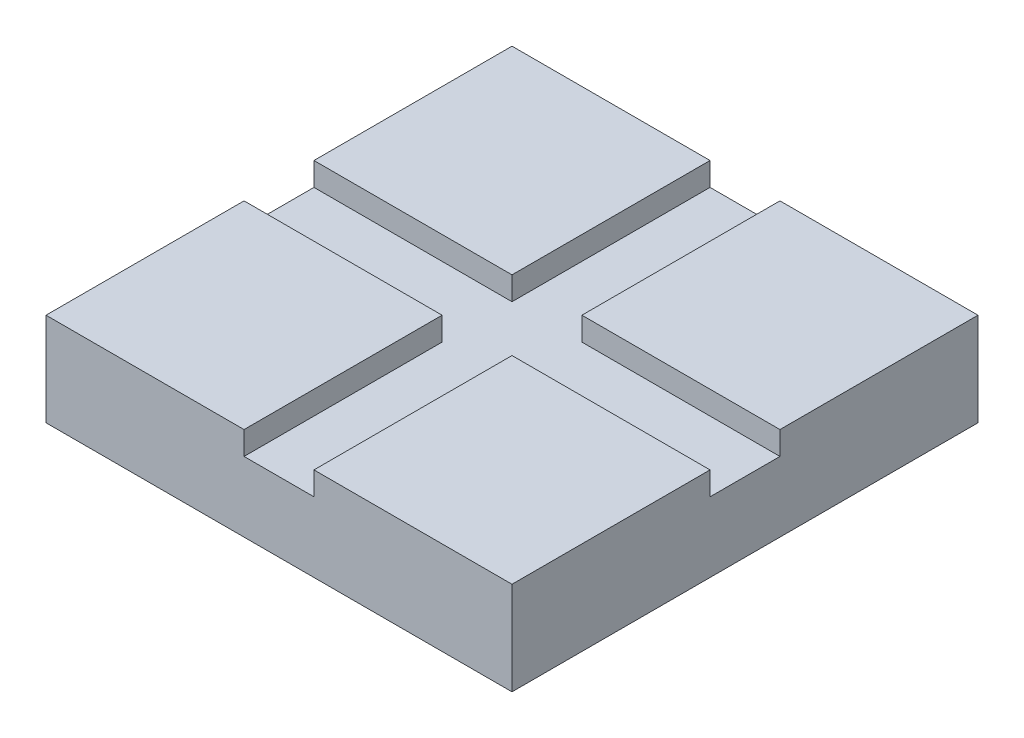
ISO-10303-21;
HEADER;
FILE_DESCRIPTION(('STEP AP214'),'2;1');
FILE_NAME('part.step','',(''),(''),'','','');
FILE_SCHEMA(('AUTOMOTIVE_DESIGN { 1 0 10303 214 1 1 1 1 }'));
ENDSEC;
DATA;
#1=APPLICATION_CONTEXT('core data for automotive mechanical design processes');
#2=APPLICATION_PROTOCOL_DEFINITION('international standard','automotive_design',2000,#1);
#3=PRODUCT_CONTEXT('',#1,'mechanical');
#4=PRODUCT('Part','Part','',(#3));
#5=PRODUCT_RELATED_PRODUCT_CATEGORY('part','',(#4));
#6=PRODUCT_DEFINITION_FORMATION('','',#4);
#7=PRODUCT_DEFINITION_CONTEXT('part definition',#1,'design');
#8=PRODUCT_DEFINITION('design','',#6,#7);
#9=PRODUCT_DEFINITION_SHAPE('','',#8);
#10=(LENGTH_UNIT() NAMED_UNIT(*) SI_UNIT(.MILLI.,.METRE.));
#11=(NAMED_UNIT(*) PLANE_ANGLE_UNIT() SI_UNIT($,.RADIAN.));
#12=(NAMED_UNIT(*) SI_UNIT($,.STERADIAN.) SOLID_ANGLE_UNIT());
#13=UNCERTAINTY_MEASURE_WITH_UNIT(LENGTH_MEASURE(1.E-05),#10,'distance_accuracy_value','');
#14=(GEOMETRIC_REPRESENTATION_CONTEXT(3) GLOBAL_UNCERTAINTY_ASSIGNED_CONTEXT((#13)) GLOBAL_UNIT_ASSIGNED_CONTEXT((#10,
#11,#12)) REPRESENTATION_CONTEXT('',''));
#15=CARTESIAN_POINT('',(0.,0.,0.));
#16=DIRECTION('',(0.,0.,1.));
#17=DIRECTION('',(1.,0.,0.));
#18=AXIS2_PLACEMENT_3D('',#15,#16,#17);
#19=CARTESIAN_POINT('',(0.,20.,-7.50000000000002));
#20=DIRECTION('',(0.,0.,-1.));
#21=DIRECTION('',(-1.,0.,0.));
#22=AXIS2_PLACEMENT_3D('',#19,#20,#21);
#23=PLANE('',#22);
#24=DIRECTION('',(0.,-1.,0.));
#25=VECTOR('',#24,1.);
#26=CARTESIAN_POINT('',(-50.,20.,-7.49999999999997));
#27=LINE('',#26,#25);
#28=CARTESIAN_POINT('',(-50.,20.,-7.49999999999997));
#29=VERTEX_POINT('',#28);
#30=CARTESIAN_POINT('',(-50.,15.,-7.49999999999997));
#31=VERTEX_POINT('',#30);
#32=EDGE_CURVE('E266',#29,#31,#27,.T.);
#33=ORIENTED_EDGE('',*,*,#32,.T.);
#34=DIRECTION('',(1.,0.,0.));
#35=VECTOR('',#34,1.);
#36=CARTESIAN_POINT('',(0.,15.,-7.50000000000002));
#37=LINE('',#36,#35);
#38=CARTESIAN_POINT('',(-7.50000000000001,15.,-7.50000000000001));
#39=VERTEX_POINT('',#38);
#40=EDGE_CURVE('E47',#31,#39,#37,.T.);
#41=ORIENTED_EDGE('',*,*,#40,.T.);
#42=DIRECTION('',(0.,-1.,0.));
#43=VECTOR('',#42,1.);
#44=CARTESIAN_POINT('',(-7.50000000000001,20.,-7.50000000000001));
#45=LINE('',#44,#43);
#46=CARTESIAN_POINT('',(-7.50000000000001,20.,-7.50000000000001));
#47=VERTEX_POINT('',#46);
#48=EDGE_CURVE('E11',#47,#39,#45,.T.);
#49=ORIENTED_EDGE('',*,*,#48,.F.);
#50=DIRECTION('',(1.,0.,0.));
#51=VECTOR('',#50,1.);
#52=CARTESIAN_POINT('',(0.,20.,-7.50000000000002));
#53=LINE('',#52,#51);
#54=EDGE_CURVE('E254',#29,#47,#53,.T.);
#55=ORIENTED_EDGE('',*,*,#54,.F.);
#56=EDGE_LOOP('',(#33,#41,#49,#55));
#57=FACE_BOUND('',#56,.T.);
#58=ADVANCED_FACE('F33',(#57),#23,.F.);
#59=CARTESIAN_POINT('',(-7.50000000000001,20.,0.));
#60=DIRECTION('',(-1.,0.,0.));
#61=DIRECTION('',(0.,0.,1.));
#62=AXIS2_PLACEMENT_3D('',#59,#60,#61);
#63=PLANE('',#62);
#64=ORIENTED_EDGE('',*,*,#48,.T.);
#65=DIRECTION('',(0.,0.,-1.));
#66=VECTOR('',#65,1.);
#67=CARTESIAN_POINT('',(-7.50000000000001,15.,0.));
#68=LINE('',#67,#66);
#69=CARTESIAN_POINT('',(-7.50000000000001,15.,-50.));
#70=VERTEX_POINT('',#69);
#71=EDGE_CURVE('E53',#39,#70,#68,.T.);
#72=ORIENTED_EDGE('',*,*,#71,.T.);
#73=DIRECTION('',(0.,-1.,0.));
#74=VECTOR('',#73,1.);
#75=CARTESIAN_POINT('',(-7.50000000000001,20.,-50.));
#76=LINE('',#75,#74);
#77=CARTESIAN_POINT('',(-7.50000000000001,20.,-50.));
#78=VERTEX_POINT('',#77);
#79=EDGE_CURVE('E40',#78,#70,#76,.T.);
#80=ORIENTED_EDGE('',*,*,#79,.F.);
#81=DIRECTION('',(0.,0.,-1.));
#82=VECTOR('',#81,1.);
#83=CARTESIAN_POINT('',(-7.50000000000001,20.,0.));
#84=LINE('',#83,#82);
#85=EDGE_CURVE('E257',#47,#78,#84,.T.);
#86=ORIENTED_EDGE('',*,*,#85,.F.);
#87=EDGE_LOOP('',(#64,#72,#80,#86));
#88=FACE_BOUND('',#87,.T.);
#89=ADVANCED_FACE('F307',(#88),#63,.F.);
#90=CARTESIAN_POINT('',(0.,20.,-50.));
#91=DIRECTION('',(0.,0.,-1.));
#92=DIRECTION('',(-1.,0.,0.));
#93=AXIS2_PLACEMENT_3D('',#90,#91,#92);
#94=PLANE('',#93);
#95=DIRECTION('',(1.,0.,0.));
#96=VECTOR('',#95,1.);
#97=CARTESIAN_POINT('',(0.,0.,-50.));
#98=LINE('',#97,#96);
#99=CARTESIAN_POINT('',(-50.,0.,-50.));
#100=VERTEX_POINT('',#99);
#101=CARTESIAN_POINT('',(50.,0.,-50.));
#102=VERTEX_POINT('',#101);
#103=EDGE_CURVE('E251',#100,#102,#98,.T.);
#104=ORIENTED_EDGE('',*,*,#103,.F.);
#105=DIRECTION('',(0.,-1.,0.));
#106=VECTOR('',#105,1.);
#107=CARTESIAN_POINT('',(-50.,20.,-50.));
#108=LINE('',#107,#106);
#109=CARTESIAN_POINT('',(-50.,20.,-50.));
#110=VERTEX_POINT('',#109);
#111=EDGE_CURVE('E272',#110,#100,#108,.T.);
#112=ORIENTED_EDGE('',*,*,#111,.F.);
#113=DIRECTION('',(1.,0.,0.));
#114=VECTOR('',#113,1.);
#115=CARTESIAN_POINT('',(0.,20.,-50.));
#116=LINE('',#115,#114);
#117=EDGE_CURVE('E260',#110,#78,#116,.T.);
#118=ORIENTED_EDGE('',*,*,#117,.T.);
#119=ORIENTED_EDGE('',*,*,#79,.T.);
#120=DIRECTION('',(1.,0.,0.));
#121=VECTOR('',#120,1.);
#122=CARTESIAN_POINT('',(0.,15.,-50.));
#123=LINE('',#122,#121);
#124=CARTESIAN_POINT('',(7.49999999999999,15.,-50.));
#125=VERTEX_POINT('',#124);
#126=EDGE_CURVE('E248',#70,#125,#123,.T.);
#127=ORIENTED_EDGE('',*,*,#126,.T.);
#128=DIRECTION('',(0.,-1.,0.));
#129=VECTOR('',#128,1.);
#130=CARTESIAN_POINT('',(7.49999999999999,20.,-50.));
#131=LINE('',#130,#129);
#132=CARTESIAN_POINT('',(7.49999999999999,20.,-50.));
#133=VERTEX_POINT('',#132);
#134=EDGE_CURVE('E211',#133,#125,#131,.T.);
#135=ORIENTED_EDGE('',*,*,#134,.F.);
#136=DIRECTION('',(1.,0.,0.));
#137=VECTOR('',#136,1.);
#138=CARTESIAN_POINT('',(0.,20.,-50.));
#139=LINE('',#138,#137);
#140=CARTESIAN_POINT('',(50.,20.,-50.));
#141=VERTEX_POINT('',#140);
#142=EDGE_CURVE('E208',#133,#141,#139,.T.);
#143=ORIENTED_EDGE('',*,*,#142,.T.);
#144=DIRECTION('',(0.,-1.,0.));
#145=VECTOR('',#144,1.);
#146=CARTESIAN_POINT('',(50.,20.,-50.));
#147=LINE('',#146,#145);
#148=EDGE_CURVE('E214',#141,#102,#147,.T.);
#149=ORIENTED_EDGE('',*,*,#148,.T.);
#150=EDGE_LOOP('',(#104,#112,#118,#119,#127,#135,#143,#149));
#151=FACE_BOUND('',#150,.T.);
#152=ADVANCED_FACE('F276',(#151),#94,.T.);
#153=CARTESIAN_POINT('',(-50.,20.,0.));
#154=DIRECTION('',(-1.,0.,0.));
#155=DIRECTION('',(0.,0.,1.));
#156=AXIS2_PLACEMENT_3D('',#153,#154,#155);
#157=PLANE('',#156);
#158=DIRECTION('',(0.,0.,-1.));
#159=VECTOR('',#158,1.);
#160=CARTESIAN_POINT('',(-50.,0.,0.));
#161=LINE('',#160,#159);
#162=CARTESIAN_POINT('',(-50.,0.,50.));
#163=VERTEX_POINT('',#162);
#164=EDGE_CURVE('E258',#163,#100,#161,.T.);
#165=ORIENTED_EDGE('',*,*,#164,.F.);
#166=DIRECTION('',(0.,-1.,0.));
#167=VECTOR('',#166,1.);
#168=CARTESIAN_POINT('',(-50.,20.,50.));
#169=LINE('',#168,#167);
#170=CARTESIAN_POINT('',(-50.,20.,50.));
#171=VERTEX_POINT('',#170);
#172=EDGE_CURVE('E195',#171,#163,#169,.T.);
#173=ORIENTED_EDGE('',*,*,#172,.F.);
#174=DIRECTION('',(0.,0.,-1.));
#175=VECTOR('',#174,1.);
#176=CARTESIAN_POINT('',(-50.,20.,0.));
#177=LINE('',#176,#175);
#178=CARTESIAN_POINT('',(-50.,20.,7.5));
#179=VERTEX_POINT('',#178);
#180=EDGE_CURVE('E182',#171,#179,#177,.T.);
#181=ORIENTED_EDGE('',*,*,#180,.T.);
#182=DIRECTION('',(0.,-1.,0.));
#183=VECTOR('',#182,1.);
#184=CARTESIAN_POINT('',(-50.,20.,7.5));
#185=LINE('',#184,#183);
#186=CARTESIAN_POINT('',(-50.,15.,7.5));
#187=VERTEX_POINT('',#186);
#188=EDGE_CURVE('E198',#179,#187,#185,.T.);
#189=ORIENTED_EDGE('',*,*,#188,.T.);
#190=DIRECTION('',(0.,0.,-1.));
#191=VECTOR('',#190,1.);
#192=CARTESIAN_POINT('',(-50.,15.,0.));
#193=LINE('',#192,#191);
#194=EDGE_CURVE('E227',#187,#31,#193,.T.);
#195=ORIENTED_EDGE('',*,*,#194,.T.);
#196=ORIENTED_EDGE('',*,*,#32,.F.);
#197=DIRECTION('',(0.,0.,-1.));
#198=VECTOR('',#197,1.);
#199=CARTESIAN_POINT('',(-50.,20.,0.));
#200=LINE('',#199,#198);
#201=EDGE_CURVE('E263',#29,#110,#200,.T.);
#202=ORIENTED_EDGE('',*,*,#201,.T.);
#203=ORIENTED_EDGE('',*,*,#111,.T.);
#204=EDGE_LOOP('',(#165,#173,#181,#189,#195,#196,#202,#203));
#205=FACE_BOUND('',#204,.T.);
#206=ADVANCED_FACE('F301',(#205),#157,.T.);
#207=CARTESIAN_POINT('',(0.,20.,0.));
#208=DIRECTION('',(0.,1.,0.));
#209=DIRECTION('',(0.,0.,1.));
#210=AXIS2_PLACEMENT_3D('',#207,#208,#209);
#211=PLANE('',#210);
#212=ORIENTED_EDGE('',*,*,#54,.T.);
#213=ORIENTED_EDGE('',*,*,#85,.T.);
#214=ORIENTED_EDGE('',*,*,#117,.F.);
#215=ORIENTED_EDGE('',*,*,#201,.F.);
#216=EDGE_LOOP('',(#212,#213,#214,#215));
#217=FACE_BOUND('',#216,.T.);
#218=ADVANCED_FACE('F305',(#217),#211,.T.);
#219=CARTESIAN_POINT('',(0.,0.,0.));
#220=DIRECTION('',(0.,1.,0.));
#221=DIRECTION('',(0.,0.,1.));
#222=AXIS2_PLACEMENT_3D('',#219,#220,#221);
#223=PLANE('',#222);
#224=ORIENTED_EDGE('',*,*,#103,.T.);
#225=DIRECTION('',(0.,0.,-1.));
#226=VECTOR('',#225,1.);
#227=CARTESIAN_POINT('',(50.,0.,0.));
#228=LINE('',#227,#226);
#229=CARTESIAN_POINT('',(50.,0.,50.));
#230=VERTEX_POINT('',#229);
#231=EDGE_CURVE('E225',#230,#102,#228,.T.);
#232=ORIENTED_EDGE('',*,*,#231,.F.);
#233=DIRECTION('',(1.,0.,0.));
#234=VECTOR('',#233,1.);
#235=CARTESIAN_POINT('',(0.,0.,50.));
#236=LINE('',#235,#234);
#237=EDGE_CURVE('E223',#163,#230,#236,.T.);
#238=ORIENTED_EDGE('',*,*,#237,.F.);
#239=ORIENTED_EDGE('',*,*,#164,.T.);
#240=EDGE_LOOP('',(#224,#232,#238,#239));
#241=FACE_BOUND('',#240,.T.);
#242=ADVANCED_FACE('F299',(#241),#223,.F.);
#243=CARTESIAN_POINT('',(0.,15.,50.));
#244=DIRECTION('',(0.,0.,-1.));
#245=DIRECTION('',(-1.,0.,0.));
#246=AXIS2_PLACEMENT_3D('',#243,#244,#245);
#247=PLANE('',#246);
#248=ORIENTED_EDGE('',*,*,#237,.T.);
#249=DIRECTION('',(0.,-1.,0.));
#250=VECTOR('',#249,1.);
#251=CARTESIAN_POINT('',(50.,20.,50.));
#252=LINE('',#251,#250);
#253=CARTESIAN_POINT('',(50.,20.,50.));
#254=VERTEX_POINT('',#253);
#255=EDGE_CURVE('E176',#254,#230,#252,.T.);
#256=ORIENTED_EDGE('',*,*,#255,.F.);
#257=DIRECTION('',(1.,0.,0.));
#258=VECTOR('',#257,1.);
#259=CARTESIAN_POINT('',(0.,20.,50.));
#260=LINE('',#259,#258);
#261=CARTESIAN_POINT('',(7.50000000000005,20.,50.));
#262=VERTEX_POINT('',#261);
#263=EDGE_CURVE('E169',#262,#254,#260,.T.);
#264=ORIENTED_EDGE('',*,*,#263,.F.);
#265=DIRECTION('',(0.,-1.,0.));
#266=VECTOR('',#265,1.);
#267=CARTESIAN_POINT('',(7.50000000000005,20.,50.));
#268=LINE('',#267,#266);
#269=CARTESIAN_POINT('',(7.50000000000005,15.,50.));
#270=VERTEX_POINT('',#269);
#271=EDGE_CURVE('E156',#262,#270,#268,.T.);
#272=ORIENTED_EDGE('',*,*,#271,.T.);
#273=DIRECTION('',(1.,0.,0.));
#274=VECTOR('',#273,1.);
#275=CARTESIAN_POINT('',(0.,15.,50.));
#276=LINE('',#275,#274);
#277=CARTESIAN_POINT('',(-7.50000000000001,15.,50.));
#278=VERTEX_POINT('',#277);
#279=EDGE_CURVE('E235',#278,#270,#276,.T.);
#280=ORIENTED_EDGE('',*,*,#279,.F.);
#281=DIRECTION('',(0.,-1.,0.));
#282=VECTOR('',#281,1.);
#283=CARTESIAN_POINT('',(-7.50000000000001,20.,50.));
#284=LINE('',#283,#282);
#285=CARTESIAN_POINT('',(-7.50000000000001,20.,50.));
#286=VERTEX_POINT('',#285);
#287=EDGE_CURVE('E192',#286,#278,#284,.T.);
#288=ORIENTED_EDGE('',*,*,#287,.F.);
#289=DIRECTION('',(1.,0.,0.));
#290=VECTOR('',#289,1.);
#291=CARTESIAN_POINT('',(0.,20.,50.));
#292=LINE('',#291,#290);
#293=EDGE_CURVE('E185',#171,#286,#292,.T.);
#294=ORIENTED_EDGE('',*,*,#293,.F.);
#295=ORIENTED_EDGE('',*,*,#172,.T.);
#296=EDGE_LOOP('',(#248,#256,#264,#272,#280,#288,#294,#295));
#297=FACE_BOUND('',#296,.T.);
#298=ADVANCED_FACE('F322',(#297),#247,.F.);
#299=CARTESIAN_POINT('',(50.,15.,0.));
#300=DIRECTION('',(-1.,0.,0.));
#301=DIRECTION('',(0.,0.,1.));
#302=AXIS2_PLACEMENT_3D('',#299,#300,#301);
#303=PLANE('',#302);
#304=ORIENTED_EDGE('',*,*,#231,.T.);
#305=ORIENTED_EDGE('',*,*,#148,.F.);
#306=DIRECTION('',(0.,0.,-1.));
#307=VECTOR('',#306,1.);
#308=CARTESIAN_POINT('',(50.,20.,0.));
#309=LINE('',#308,#307);
#310=CARTESIAN_POINT('',(50.,20.,-7.5));
#311=VERTEX_POINT('',#310);
#312=EDGE_CURVE('E206',#311,#141,#309,.T.);
#313=ORIENTED_EDGE('',*,*,#312,.F.);
#314=DIRECTION('',(0.,-1.,0.));
#315=VECTOR('',#314,1.);
#316=CARTESIAN_POINT('',(50.,20.,-7.5));
#317=LINE('',#316,#315);
#318=CARTESIAN_POINT('',(50.,15.,-7.5));
#319=VERTEX_POINT('',#318);
#320=EDGE_CURVE('E217',#311,#319,#317,.T.);
#321=ORIENTED_EDGE('',*,*,#320,.T.);
#322=DIRECTION('',(0.,0.,-1.));
#323=VECTOR('',#322,1.);
#324=CARTESIAN_POINT('',(50.,15.,0.));
#325=LINE('',#324,#323);
#326=CARTESIAN_POINT('',(50.,15.,7.5));
#327=VERTEX_POINT('',#326);
#328=EDGE_CURVE('E241',#327,#319,#325,.T.);
#329=ORIENTED_EDGE('',*,*,#328,.F.);
#330=DIRECTION('',(0.,-1.,0.));
#331=VECTOR('',#330,1.);
#332=CARTESIAN_POINT('',(50.,20.,7.5));
#333=LINE('',#332,#331);
#334=CARTESIAN_POINT('',(50.,20.,7.5));
#335=VERTEX_POINT('',#334);
#336=EDGE_CURVE('E174',#335,#327,#333,.T.);
#337=ORIENTED_EDGE('',*,*,#336,.F.);
#338=DIRECTION('',(0.,0.,-1.));
#339=VECTOR('',#338,1.);
#340=CARTESIAN_POINT('',(50.,20.,0.));
#341=LINE('',#340,#339);
#342=EDGE_CURVE('E163',#254,#335,#341,.T.);
#343=ORIENTED_EDGE('',*,*,#342,.F.);
#344=ORIENTED_EDGE('',*,*,#255,.T.);
#345=EDGE_LOOP('',(#304,#305,#313,#321,#329,#337,#343,#344));
#346=FACE_BOUND('',#345,.T.);
#347=ADVANCED_FACE('F294',(#346),#303,.F.);
#348=CARTESIAN_POINT('',(0.,15.,0.));
#349=DIRECTION('',(0.,1.,0.));
#350=DIRECTION('',(0.,0.,1.));
#351=AXIS2_PLACEMENT_3D('',#348,#349,#350);
#352=PLANE('',#351);
#353=ORIENTED_EDGE('',*,*,#71,.F.);
#354=ORIENTED_EDGE('',*,*,#40,.F.);
#355=ORIENTED_EDGE('',*,*,#194,.F.);
#356=DIRECTION('',(1.,0.,0.));
#357=VECTOR('',#356,1.);
#358=CARTESIAN_POINT('',(0.,15.,7.5));
#359=LINE('',#358,#357);
#360=CARTESIAN_POINT('',(-7.50000000000001,15.,7.5));
#361=VERTEX_POINT('',#360);
#362=EDGE_CURVE('E230',#187,#361,#359,.T.);
#363=ORIENTED_EDGE('',*,*,#362,.T.);
#364=DIRECTION('',(0.,0.,-1.));
#365=VECTOR('',#364,1.);
#366=CARTESIAN_POINT('',(-7.50000000000001,15.,0.));
#367=LINE('',#366,#365);
#368=EDGE_CURVE('E232',#278,#361,#367,.T.);
#369=ORIENTED_EDGE('',*,*,#368,.F.);
#370=ORIENTED_EDGE('',*,*,#279,.T.);
#371=DIRECTION('',(0.,0.,-1.));
#372=VECTOR('',#371,1.);
#373=CARTESIAN_POINT('',(7.50000000000002,15.,0.));
#374=LINE('',#373,#372);
#375=CARTESIAN_POINT('',(7.50000000000002,15.,7.50000000000001));
#376=VERTEX_POINT('',#375);
#377=EDGE_CURVE('E238',#270,#376,#374,.T.);
#378=ORIENTED_EDGE('',*,*,#377,.T.);
#379=DIRECTION('',(1.,0.,0.));
#380=VECTOR('',#379,1.);
#381=CARTESIAN_POINT('',(0.,15.,7.50000000000002));
#382=LINE('',#381,#380);
#383=EDGE_CURVE('E151',#376,#327,#382,.T.);
#384=ORIENTED_EDGE('',*,*,#383,.T.);
#385=ORIENTED_EDGE('',*,*,#328,.T.);
#386=DIRECTION('',(1.,0.,0.));
#387=VECTOR('',#386,1.);
#388=CARTESIAN_POINT('',(0.,15.,-7.49999999999998));
#389=LINE('',#388,#387);
#390=CARTESIAN_POINT('',(7.49999999999997,15.,-7.49999999999998));
#391=VERTEX_POINT('',#390);
#392=EDGE_CURVE('E243',#391,#319,#389,.T.);
#393=ORIENTED_EDGE('',*,*,#392,.F.);
#394=DIRECTION('',(0.,0.,-1.));
#395=VECTOR('',#394,1.);
#396=CARTESIAN_POINT('',(7.49999999999997,15.,0.));
#397=LINE('',#396,#395);
#398=EDGE_CURVE('E246',#391,#125,#397,.T.);
#399=ORIENTED_EDGE('',*,*,#398,.T.);
#400=ORIENTED_EDGE('',*,*,#126,.F.);
#401=EDGE_LOOP('',(#353,#354,#355,#363,#369,#370,#378,#384,#385,#393,#399,#400));
#402=FACE_BOUND('',#401,.T.);
#403=ADVANCED_FACE('F279',(#402),#352,.T.);
#404=CARTESIAN_POINT('',(7.49999999999997,20.,0.));
#405=DIRECTION('',(-1.,0.,0.));
#406=DIRECTION('',(0.,0.,1.));
#407=AXIS2_PLACEMENT_3D('',#404,#405,#406);
#408=PLANE('',#407);
#409=ORIENTED_EDGE('',*,*,#134,.T.);
#410=ORIENTED_EDGE('',*,*,#398,.F.);
#411=DIRECTION('',(0.,-1.,0.));
#412=VECTOR('',#411,1.);
#413=CARTESIAN_POINT('',(7.49999999999997,20.,-7.49999999999998));
#414=LINE('',#413,#412);
#415=CARTESIAN_POINT('',(7.49999999999997,20.,-7.49999999999998));
#416=VERTEX_POINT('',#415);
#417=EDGE_CURVE('E220',#416,#391,#414,.T.);
#418=ORIENTED_EDGE('',*,*,#417,.F.);
#419=DIRECTION('',(0.,0.,-1.));
#420=VECTOR('',#419,1.);
#421=CARTESIAN_POINT('',(7.49999999999997,20.,0.));
#422=LINE('',#421,#420);
#423=EDGE_CURVE('E201',#416,#133,#422,.T.);
#424=ORIENTED_EDGE('',*,*,#423,.T.);
#425=EDGE_LOOP('',(#409,#410,#418,#424));
#426=FACE_BOUND('',#425,.T.);
#427=ADVANCED_FACE('F282',(#426),#408,.T.);
#428=CARTESIAN_POINT('',(0.,20.,-7.49999999999998));
#429=DIRECTION('',(0.,0.,-1.));
#430=DIRECTION('',(-1.,0.,0.));
#431=AXIS2_PLACEMENT_3D('',#428,#429,#430);
#432=PLANE('',#431);
#433=ORIENTED_EDGE('',*,*,#392,.T.);
#434=ORIENTED_EDGE('',*,*,#320,.F.);
#435=DIRECTION('',(1.,0.,0.));
#436=VECTOR('',#435,1.);
#437=CARTESIAN_POINT('',(0.,20.,-7.49999999999998));
#438=LINE('',#437,#436);
#439=EDGE_CURVE('E204',#416,#311,#438,.T.);
#440=ORIENTED_EDGE('',*,*,#439,.F.);
#441=ORIENTED_EDGE('',*,*,#417,.T.);
#442=EDGE_LOOP('',(#433,#434,#440,#441));
#443=FACE_BOUND('',#442,.T.);
#444=ADVANCED_FACE('F285',(#443),#432,.F.);
#445=CARTESIAN_POINT('',(0.,20.,0.));
#446=DIRECTION('',(0.,1.,0.));
#447=DIRECTION('',(0.,0.,1.));
#448=AXIS2_PLACEMENT_3D('',#445,#446,#447);
#449=PLANE('',#448);
#450=ORIENTED_EDGE('',*,*,#423,.F.);
#451=ORIENTED_EDGE('',*,*,#439,.T.);
#452=ORIENTED_EDGE('',*,*,#312,.T.);
#453=ORIENTED_EDGE('',*,*,#142,.F.);
#454=EDGE_LOOP('',(#450,#451,#452,#453));
#455=FACE_BOUND('',#454,.T.);
#456=ADVANCED_FACE('F291',(#455),#449,.T.);
#457=CARTESIAN_POINT('',(0.,20.,7.5));
#458=DIRECTION('',(0.,0.,-1.));
#459=DIRECTION('',(-1.,0.,0.));
#460=AXIS2_PLACEMENT_3D('',#457,#458,#459);
#461=PLANE('',#460);
#462=DIRECTION('',(0.,-1.,0.));
#463=VECTOR('',#462,1.);
#464=CARTESIAN_POINT('',(-7.50000000000001,20.,7.5));
#465=LINE('',#464,#463);
#466=CARTESIAN_POINT('',(-7.50000000000001,20.,7.5));
#467=VERTEX_POINT('',#466);
#468=EDGE_CURVE('E189',#467,#361,#465,.T.);
#469=ORIENTED_EDGE('',*,*,#468,.T.);
#470=ORIENTED_EDGE('',*,*,#362,.F.);
#471=ORIENTED_EDGE('',*,*,#188,.F.);
#472=DIRECTION('',(1.,0.,0.));
#473=VECTOR('',#472,1.);
#474=CARTESIAN_POINT('',(0.,20.,7.5));
#475=LINE('',#474,#473);
#476=EDGE_CURVE('E155',#179,#467,#475,.T.);
#477=ORIENTED_EDGE('',*,*,#476,.T.);
#478=EDGE_LOOP('',(#469,#470,#471,#477));
#479=FACE_BOUND('',#478,.T.);
#480=ADVANCED_FACE('F312',(#479),#461,.T.);
#481=CARTESIAN_POINT('',(-7.50000000000001,20.,0.));
#482=DIRECTION('',(-1.,0.,0.));
#483=DIRECTION('',(0.,0.,1.));
#484=AXIS2_PLACEMENT_3D('',#481,#482,#483);
#485=PLANE('',#484);
#486=ORIENTED_EDGE('',*,*,#368,.T.);
#487=ORIENTED_EDGE('',*,*,#468,.F.);
#488=DIRECTION('',(0.,0.,-1.));
#489=VECTOR('',#488,1.);
#490=CARTESIAN_POINT('',(-7.50000000000001,20.,0.));
#491=LINE('',#490,#489);
#492=EDGE_CURVE('E187',#286,#467,#491,.T.);
#493=ORIENTED_EDGE('',*,*,#492,.F.);
#494=ORIENTED_EDGE('',*,*,#287,.T.);
#495=EDGE_LOOP('',(#486,#487,#493,#494));
#496=FACE_BOUND('',#495,.T.);
#497=ADVANCED_FACE('F319',(#496),#485,.F.);
#498=CARTESIAN_POINT('',(0.,20.,0.));
#499=DIRECTION('',(0.,1.,0.));
#500=DIRECTION('',(0.,0.,1.));
#501=AXIS2_PLACEMENT_3D('',#498,#499,#500);
#502=PLANE('',#501);
#503=ORIENTED_EDGE('',*,*,#476,.F.);
#504=ORIENTED_EDGE('',*,*,#180,.F.);
#505=ORIENTED_EDGE('',*,*,#293,.T.);
#506=ORIENTED_EDGE('',*,*,#492,.T.);
#507=EDGE_LOOP('',(#503,#504,#505,#506));
#508=FACE_BOUND('',#507,.T.);
#509=ADVANCED_FACE('F314',(#508),#502,.T.);
#510=CARTESIAN_POINT('',(0.,20.,7.50000000000002));
#511=DIRECTION('',(0.,0.,-1.));
#512=DIRECTION('',(-1.,0.,0.));
#513=AXIS2_PLACEMENT_3D('',#510,#511,#512);
#514=PLANE('',#513);
#515=ORIENTED_EDGE('',*,*,#336,.T.);
#516=ORIENTED_EDGE('',*,*,#383,.F.);
#517=DIRECTION('',(0.,-1.,0.));
#518=VECTOR('',#517,1.);
#519=CARTESIAN_POINT('',(7.50000000000002,20.,7.50000000000001));
#520=LINE('',#519,#518);
#521=CARTESIAN_POINT('',(7.50000000000002,20.,7.50000000000001));
#522=VERTEX_POINT('',#521);
#523=EDGE_CURVE('E146',#522,#376,#520,.T.);
#524=ORIENTED_EDGE('',*,*,#523,.F.);
#525=DIRECTION('',(1.,0.,0.));
#526=VECTOR('',#525,1.);
#527=CARTESIAN_POINT('',(0.,20.,7.50000000000002));
#528=LINE('',#527,#526);
#529=EDGE_CURVE('E149',#522,#335,#528,.T.);
#530=ORIENTED_EDGE('',*,*,#529,.T.);
#531=EDGE_LOOP('',(#515,#516,#524,#530));
#532=FACE_BOUND('',#531,.T.);
#533=ADVANCED_FACE('F148',(#532),#514,.T.);
#534=CARTESIAN_POINT('',(7.50000000000002,20.,0.));
#535=DIRECTION('',(-1.,0.,0.));
#536=DIRECTION('',(0.,0.,1.));
#537=AXIS2_PLACEMENT_3D('',#534,#535,#536);
#538=PLANE('',#537);
#539=ORIENTED_EDGE('',*,*,#523,.T.);
#540=ORIENTED_EDGE('',*,*,#377,.F.);
#541=ORIENTED_EDGE('',*,*,#271,.F.);
#542=DIRECTION('',(0.,0.,-1.));
#543=VECTOR('',#542,1.);
#544=CARTESIAN_POINT('',(7.50000000000002,20.,0.));
#545=LINE('',#544,#543);
#546=EDGE_CURVE('E161',#262,#522,#545,.T.);
#547=ORIENTED_EDGE('',*,*,#546,.T.);
#548=EDGE_LOOP('',(#539,#540,#541,#547));
#549=FACE_BOUND('',#548,.T.);
#550=ADVANCED_FACE('F166',(#549),#538,.T.);
#551=CARTESIAN_POINT('',(0.,20.,0.));
#552=DIRECTION('',(0.,1.,0.));
#553=DIRECTION('',(0.,0.,1.));
#554=AXIS2_PLACEMENT_3D('',#551,#552,#553);
#555=PLANE('',#554);
#556=ORIENTED_EDGE('',*,*,#529,.F.);
#557=ORIENTED_EDGE('',*,*,#546,.F.);
#558=ORIENTED_EDGE('',*,*,#263,.T.);
#559=ORIENTED_EDGE('',*,*,#342,.T.);
#560=EDGE_LOOP('',(#556,#557,#558,#559));
#561=FACE_BOUND('',#560,.T.);
#562=ADVANCED_FACE('F160',(#561),#555,.T.);
#563=CLOSED_SHELL('',(#58,#89,#152,#206,#218,#242,#298,#347,#403,#427,#444,#456,#480,#497,#509,
#533,#550,#562));
#564=MANIFOLD_SOLID_BREP('B2',#563);
#565=ADVANCED_BREP_SHAPE_REPRESENTATION('',(#18,#564),#14);
#566=SHAPE_DEFINITION_REPRESENTATION(#9,#565);
ENDSEC;
END-ISO-10303-21;
